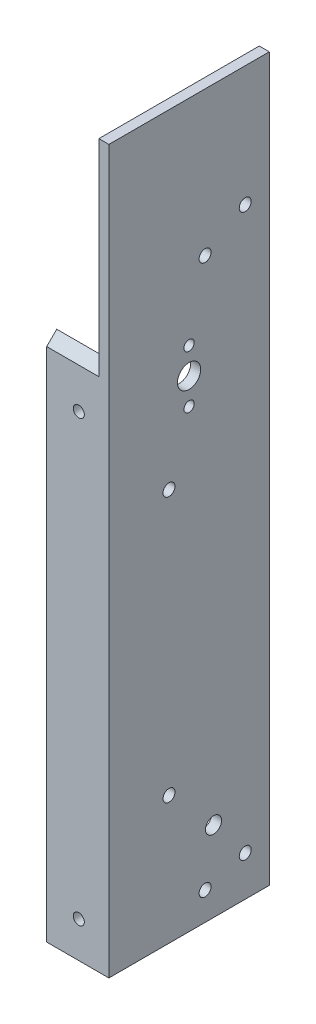
ISO-10303-21;
HEADER;
FILE_DESCRIPTION(('STEP AP214'),'2;1');
FILE_NAME('part.step','',(''),(''),'','','');
FILE_SCHEMA(('AUTOMOTIVE_DESIGN { 1 0 10303 214 1 1 1 1 }'));
ENDSEC;
DATA;
#1=APPLICATION_CONTEXT('core data for automotive mechanical design processes');
#2=APPLICATION_PROTOCOL_DEFINITION('international standard','automotive_design',2000,#1);
#3=PRODUCT_CONTEXT('',#1,'mechanical');
#4=PRODUCT('Part','Part','',(#3));
#5=PRODUCT_RELATED_PRODUCT_CATEGORY('part','',(#4));
#6=PRODUCT_DEFINITION_FORMATION('','',#4);
#7=PRODUCT_DEFINITION_CONTEXT('part definition',#1,'design');
#8=PRODUCT_DEFINITION('design','',#6,#7);
#9=PRODUCT_DEFINITION_SHAPE('','',#8);
#10=(LENGTH_UNIT() NAMED_UNIT(*) SI_UNIT(.MILLI.,.METRE.));
#11=(NAMED_UNIT(*) PLANE_ANGLE_UNIT() SI_UNIT($,.RADIAN.));
#12=(NAMED_UNIT(*) SI_UNIT($,.STERADIAN.) SOLID_ANGLE_UNIT());
#13=UNCERTAINTY_MEASURE_WITH_UNIT(LENGTH_MEASURE(1.E-05),#10,'distance_accuracy_value','');
#14=(GEOMETRIC_REPRESENTATION_CONTEXT(3) GLOBAL_UNCERTAINTY_ASSIGNED_CONTEXT((#13)) GLOBAL_UNIT_ASSIGNED_CONTEXT((#10,
#11,#12)) REPRESENTATION_CONTEXT('',''));
#15=CARTESIAN_POINT('',(0.,0.,0.));
#16=DIRECTION('',(0.,0.,1.));
#17=DIRECTION('',(1.,0.,0.));
#18=AXIS2_PLACEMENT_3D('',#15,#16,#17);
#19=CARTESIAN_POINT('',(0.,163.322,0.));
#20=DIRECTION('',(0.,-0.707106781186543,-0.707106781186552));
#21=DIRECTION('',(0.,0.707106781186552,-0.707106781186543));
#22=AXIS2_PLACEMENT_3D('',#19,#20,#21);
#23=PLANE('',#22);
#24=DIRECTION('',(0.,0.707106781186552,-0.707106781186543));
#25=VECTOR('',#24,1.);
#26=CARTESIAN_POINT('',(-3.175,163.322,0.));
#27=LINE('',#26,#25);
#28=CARTESIAN_POINT('',(-3.175,163.322,0.));
#29=VERTEX_POINT('',#28);
#30=CARTESIAN_POINT('',(-3.175,166.497,-3.175));
#31=VERTEX_POINT('',#30);
#32=EDGE_CURVE('E127',#29,#31,#27,.T.);
#33=ORIENTED_EDGE('',*,*,#32,.T.);
#34=DIRECTION('',(-1.,0.,0.));
#35=VECTOR('',#34,1.);
#36=CARTESIAN_POINT('',(-19.685,166.497,-3.17499999999999));
#37=LINE('',#36,#35);
#38=CARTESIAN_POINT('',(-19.685,166.497,-3.17499999999999));
#39=VERTEX_POINT('',#38);
#40=EDGE_CURVE('E196',#31,#39,#37,.T.);
#41=ORIENTED_EDGE('',*,*,#40,.T.);
#42=DIRECTION('',(0.,-0.707106781186552,0.707106781186543));
#43=VECTOR('',#42,1.);
#44=CARTESIAN_POINT('',(-19.685,163.322,0.));
#45=LINE('',#44,#43);
#46=CARTESIAN_POINT('',(-19.685,163.322,0.));
#47=VERTEX_POINT('',#46);
#48=EDGE_CURVE('E191',#39,#47,#45,.T.);
#49=ORIENTED_EDGE('',*,*,#48,.T.);
#50=DIRECTION('',(-1.,0.,0.));
#51=VECTOR('',#50,1.);
#52=CARTESIAN_POINT('',(0.,163.322,0.));
#53=LINE('',#52,#51);
#54=EDGE_CURVE('E194',#29,#47,#53,.T.);
#55=ORIENTED_EDGE('',*,*,#54,.F.);
#56=EDGE_LOOP('',(#33,#41,#49,#55));
#57=FACE_BOUND('',#56,.T.);
#58=ADVANCED_FACE('F46',(#57),#23,.F.);
#59=CARTESIAN_POINT('',(-19.685,203.2,0.));
#60=DIRECTION('',(-1.,0.,0.));
#61=DIRECTION('',(0.,0.,1.));
#62=AXIS2_PLACEMENT_3D('',#59,#60,#61);
#63=PLANE('',#62);
#64=ORIENTED_EDGE('',*,*,#48,.F.);
#65=DIRECTION('',(0.,-1.,0.));
#66=VECTOR('',#65,1.);
#67=CARTESIAN_POINT('',(-19.685,203.2,-3.17499999999999));
#68=LINE('',#67,#66);
#69=CARTESIAN_POINT('',(-19.685,0.,-3.17499999999999));
#70=VERTEX_POINT('',#69);
#71=EDGE_CURVE('E211',#39,#70,#68,.T.);
#72=ORIENTED_EDGE('',*,*,#71,.T.);
#73=DIRECTION('',(0.,0.,-1.));
#74=VECTOR('',#73,1.);
#75=CARTESIAN_POINT('',(-19.685,0.,0.));
#76=LINE('',#75,#74);
#77=CARTESIAN_POINT('',(-19.685,0.,0.));
#78=VERTEX_POINT('',#77);
#79=EDGE_CURVE('E198',#78,#70,#76,.T.);
#80=ORIENTED_EDGE('',*,*,#79,.F.);
#81=DIRECTION('',(0.,-1.,0.));
#82=VECTOR('',#81,1.);
#83=CARTESIAN_POINT('',(-19.685,203.2,0.));
#84=LINE('',#83,#82);
#85=EDGE_CURVE('E13',#47,#78,#84,.T.);
#86=ORIENTED_EDGE('',*,*,#85,.F.);
#87=EDGE_LOOP('',(#64,#72,#80,#86));
#88=FACE_BOUND('',#87,.T.);
#89=ADVANCED_FACE('F48',(#88),#63,.T.);
#90=CARTESIAN_POINT('',(0.,203.2,0.));
#91=DIRECTION('',(0.,0.,1.));
#92=DIRECTION('',(1.,0.,0.));
#93=AXIS2_PLACEMENT_3D('',#90,#91,#92);
#94=PLANE('',#93);
#95=CARTESIAN_POINT('',(-9.525,150.603948775786,0.));
#96=DIRECTION('',(0.,0.,-1.));
#97=DIRECTION('',(-1.,0.,0.));
#98=AXIS2_PLACEMENT_3D('',#95,#96,#97);
#99=CIRCLE('',#98,1.7526);
#100=CARTESIAN_POINT('',(-11.2776,150.603948775786,0.));
#101=VERTEX_POINT('',#100);
#102=EDGE_CURVE('E145',#101,#101,#99,.T.);
#103=ORIENTED_EDGE('',*,*,#102,.T.);
#104=EDGE_LOOP('',(#103));
#105=FACE_BOUND('',#104,.T.);
#106=CARTESIAN_POINT('',(-9.52500000000002,11.43,0.));
#107=DIRECTION('',(0.,0.,-1.));
#108=DIRECTION('',(-1.,0.,0.));
#109=AXIS2_PLACEMENT_3D('',#106,#107,#108);
#110=CIRCLE('',#109,1.7526);
#111=CARTESIAN_POINT('',(-11.2776,11.43,0.));
#112=VERTEX_POINT('',#111);
#113=EDGE_CURVE('E151',#112,#112,#110,.T.);
#114=ORIENTED_EDGE('',*,*,#113,.T.);
#115=EDGE_LOOP('',(#114));
#116=FACE_BOUND('',#115,.T.);
#117=DIRECTION('',(0.,-1.,0.));
#118=VECTOR('',#117,1.);
#119=CARTESIAN_POINT('',(0.,203.2,0.));
#120=LINE('',#119,#118);
#121=CARTESIAN_POINT('',(0.,228.6,0.));
#122=VERTEX_POINT('',#121);
#123=CARTESIAN_POINT('',(0.,0.,0.));
#124=VERTEX_POINT('',#123);
#125=EDGE_CURVE('E55',#122,#124,#120,.T.);
#126=ORIENTED_EDGE('',*,*,#125,.F.);
#127=DIRECTION('',(1.,0.,0.));
#128=VECTOR('',#127,1.);
#129=CARTESIAN_POINT('',(-3.175,228.6,0.));
#130=LINE('',#129,#128);
#131=CARTESIAN_POINT('',(-3.175,228.6,0.));
#132=VERTEX_POINT('',#131);
#133=EDGE_CURVE('E126',#132,#122,#130,.T.);
#134=ORIENTED_EDGE('',*,*,#133,.F.);
#135=DIRECTION('',(0.,-1.,0.));
#136=VECTOR('',#135,1.);
#137=CARTESIAN_POINT('',(-3.175,228.6,0.));
#138=LINE('',#137,#136);
#139=EDGE_CURVE('E133',#132,#29,#138,.T.);
#140=ORIENTED_EDGE('',*,*,#139,.T.);
#141=ORIENTED_EDGE('',*,*,#54,.T.);
#142=ORIENTED_EDGE('',*,*,#85,.T.);
#143=DIRECTION('',(-1.,0.,0.));
#144=VECTOR('',#143,1.);
#145=CARTESIAN_POINT('',(0.,0.,0.));
#146=LINE('',#145,#144);
#147=EDGE_CURVE('E209',#124,#78,#146,.T.);
#148=ORIENTED_EDGE('',*,*,#147,.F.);
#149=EDGE_LOOP('',(#126,#134,#140,#141,#142,#148));
#150=FACE_BOUND('',#149,.T.);
#151=ADVANCED_FACE('F240',(#105,#116,#150),#94,.T.);
#152=CARTESIAN_POINT('',(0.,203.2,-50.8));
#153=DIRECTION('',(1.,0.,0.));
#154=DIRECTION('',(0.,0.,-1.));
#155=AXIS2_PLACEMENT_3D('',#152,#153,#154);
#156=PLANE('',#155);
#157=CARTESIAN_POINT('',(0.,190.498941663727,-43.1799999999999));
#158=DIRECTION('',(-1.,0.,0.));
#159=DIRECTION('',(0.,0.,1.));
#160=AXIS2_PLACEMENT_3D('',#157,#158,#159);
#161=CIRCLE('',#160,1.89864999999999);
#162=CARTESIAN_POINT('',(0.,190.498941663727,-41.28135));
#163=VERTEX_POINT('',#162);
#164=EDGE_CURVE('E497',#163,#163,#161,.T.);
#165=ORIENTED_EDGE('',*,*,#164,.T.);
#166=EDGE_LOOP('',(#165));
#167=FACE_BOUND('',#166,.T.);
#168=CARTESIAN_POINT('',(0.,12.7,-43.1799999999999));
#169=DIRECTION('',(-1.,0.,0.));
#170=DIRECTION('',(0.,0.,1.));
#171=AXIS2_PLACEMENT_3D('',#168,#169,#170);
#172=CIRCLE('',#171,1.89865);
#173=CARTESIAN_POINT('',(0.,12.7,-41.2813499999999));
#174=VERTEX_POINT('',#173);
#175=EDGE_CURVE('E490',#174,#174,#172,.T.);
#176=ORIENTED_EDGE('',*,*,#175,.T.);
#177=EDGE_LOOP('',(#176));
#178=FACE_BOUND('',#177,.T.);
#179=CARTESIAN_POINT('',(0.,25.4,-33.1361964987955));
#180=DIRECTION('',(-1.,0.,0.));
#181=DIRECTION('',(0.,0.,1.));
#182=AXIS2_PLACEMENT_3D('',#179,#180,#181);
#183=CIRCLE('',#182,2.54000000000001);
#184=CARTESIAN_POINT('',(0.,25.4,-30.5961964987955));
#185=VERTEX_POINT('',#184);
#186=EDGE_CURVE('E136',#185,#185,#183,.T.);
#187=ORIENTED_EDGE('',*,*,#186,.T.);
#188=EDGE_LOOP('',(#187));
#189=FACE_BOUND('',#188,.T.);
#190=CARTESIAN_POINT('',(0.,124.397339992382,-19.05));
#191=DIRECTION('',(-1.,0.,0.));
#192=DIRECTION('',(0.,0.,1.));
#193=AXIS2_PLACEMENT_3D('',#190,#191,#192);
#194=CIRCLE('',#193,1.89865);
#195=CARTESIAN_POINT('',(0.,124.397339992382,-17.15135));
#196=VERTEX_POINT('',#195);
#197=EDGE_CURVE('E157',#196,#196,#194,.T.);
#198=ORIENTED_EDGE('',*,*,#197,.T.);
#199=EDGE_LOOP('',(#198));
#200=FACE_BOUND('',#199,.T.);
#201=CARTESIAN_POINT('',(0.,40.5773399923822,-19.05));
#202=DIRECTION('',(-1.,0.,0.));
#203=DIRECTION('',(0.,0.,1.));
#204=AXIS2_PLACEMENT_3D('',#201,#202,#203);
#205=CIRCLE('',#204,1.89865);
#206=CARTESIAN_POINT('',(0.,40.5773399923822,-17.15135));
#207=VERTEX_POINT('',#206);
#208=EDGE_CURVE('E163',#207,#207,#205,.T.);
#209=ORIENTED_EDGE('',*,*,#208,.T.);
#210=EDGE_LOOP('',(#209));
#211=FACE_BOUND('',#210,.T.);
#212=CARTESIAN_POINT('',(0.,8.89000000000001,-30.48));
#213=DIRECTION('',(-1.,0.,0.));
#214=DIRECTION('',(0.,0.,1.));
#215=AXIS2_PLACEMENT_3D('',#212,#213,#214);
#216=CIRCLE('',#215,1.89865);
#217=CARTESIAN_POINT('',(0.,8.89000000000001,-28.58135));
#218=VERTEX_POINT('',#217);
#219=EDGE_CURVE('E169',#218,#218,#216,.T.);
#220=ORIENTED_EDGE('',*,*,#219,.T.);
#221=EDGE_LOOP('',(#220));
#222=FACE_BOUND('',#221,.T.);
#223=CARTESIAN_POINT('',(0.,182.88,-30.4799999999998));
#224=DIRECTION('',(-1.,0.,0.));
#225=DIRECTION('',(0.,0.,1.));
#226=AXIS2_PLACEMENT_3D('',#223,#224,#225);
#227=CIRCLE('',#226,1.89865);
#228=CARTESIAN_POINT('',(0.,182.88,-28.5813499999998));
#229=VERTEX_POINT('',#228);
#230=EDGE_CURVE('E175',#229,#229,#227,.T.);
#231=ORIENTED_EDGE('',*,*,#230,.T.);
#232=EDGE_LOOP('',(#231));
#233=FACE_BOUND('',#232,.T.);
#234=CARTESIAN_POINT('',(0.,144.018,-25.4));
#235=DIRECTION('',(1.,0.,0.));
#236=DIRECTION('',(0.,0.,-1.));
#237=AXIS2_PLACEMENT_3D('',#234,#235,#236);
#238=CIRCLE('',#237,1.63195000000001);
#239=CARTESIAN_POINT('',(0.,144.018,-27.03195));
#240=VERTEX_POINT('',#239);
#241=EDGE_CURVE('E178',#240,#240,#238,.T.);
#242=ORIENTED_EDGE('',*,*,#241,.F.);
#243=EDGE_LOOP('',(#242));
#244=FACE_BOUND('',#243,.T.);
#245=CARTESIAN_POINT('',(0.,160.782,-25.4));
#246=DIRECTION('',(1.,0.,0.));
#247=DIRECTION('',(0.,0.,-1.));
#248=AXIS2_PLACEMENT_3D('',#245,#246,#247);
#249=CIRCLE('',#248,1.63195000000002);
#250=CARTESIAN_POINT('',(0.,160.782,-27.03195));
#251=VERTEX_POINT('',#250);
#252=EDGE_CURVE('E183',#251,#251,#249,.T.);
#253=ORIENTED_EDGE('',*,*,#252,.F.);
#254=EDGE_LOOP('',(#253));
#255=FACE_BOUND('',#254,.T.);
#256=CARTESIAN_POINT('',(0.,152.4,-25.4));
#257=DIRECTION('',(1.,0.,0.));
#258=DIRECTION('',(0.,0.,-1.));
#259=AXIS2_PLACEMENT_3D('',#256,#257,#258);
#260=CIRCLE('',#259,3.68299999999999);
#261=CARTESIAN_POINT('',(0.,152.4,-29.083));
#262=VERTEX_POINT('',#261);
#263=EDGE_CURVE('E187',#262,#262,#260,.T.);
#264=ORIENTED_EDGE('',*,*,#263,.F.);
#265=EDGE_LOOP('',(#264));
#266=FACE_BOUND('',#265,.T.);
#267=DIRECTION('',(0.,-1.,0.));
#268=VECTOR('',#267,1.);
#269=CARTESIAN_POINT('',(0.,203.2,-50.8));
#270=LINE('',#269,#268);
#271=CARTESIAN_POINT('',(0.,228.6,-50.8));
#272=VERTEX_POINT('',#271);
#273=CARTESIAN_POINT('',(0.,0.,-50.8));
#274=VERTEX_POINT('',#273);
#275=EDGE_CURVE('E117',#272,#274,#270,.T.);
#276=ORIENTED_EDGE('',*,*,#275,.F.);
#277=DIRECTION('',(0.,0.,1.));
#278=VECTOR('',#277,1.);
#279=CARTESIAN_POINT('',(0.,228.6,-50.8));
#280=LINE('',#279,#278);
#281=EDGE_CURVE('E125',#272,#122,#280,.T.);
#282=ORIENTED_EDGE('',*,*,#281,.T.);
#283=ORIENTED_EDGE('',*,*,#125,.T.);
#284=DIRECTION('',(0.,0.,1.));
#285=VECTOR('',#284,1.);
#286=CARTESIAN_POINT('',(0.,0.,-50.8));
#287=LINE('',#286,#285);
#288=EDGE_CURVE('E207',#274,#124,#287,.T.);
#289=ORIENTED_EDGE('',*,*,#288,.F.);
#290=EDGE_LOOP('',(#276,#282,#283,#289));
#291=FACE_BOUND('',#290,.T.);
#292=ADVANCED_FACE('F238',(#167,#178,#189,#200,#211,#222,#233,#244,#255,#266,#291),#156,.T.);
#293=CARTESIAN_POINT('',(-3.17500000000002,203.2,-50.8));
#294=DIRECTION('',(0.,0.,-1.));
#295=DIRECTION('',(-1.,0.,0.));
#296=AXIS2_PLACEMENT_3D('',#293,#294,#295);
#297=PLANE('',#296);
#298=DIRECTION('',(1.,0.,0.));
#299=VECTOR('',#298,1.);
#300=CARTESIAN_POINT('',(-3.17500000000002,0.,-50.8));
#301=LINE('',#300,#299);
#302=CARTESIAN_POINT('',(-3.17500000000002,0.,-50.8));
#303=VERTEX_POINT('',#302);
#304=EDGE_CURVE('E112',#303,#274,#301,.T.);
#305=ORIENTED_EDGE('',*,*,#304,.F.);
#306=DIRECTION('',(0.,-1.,0.));
#307=VECTOR('',#306,1.);
#308=CARTESIAN_POINT('',(-3.17500000000002,203.2,-50.8));
#309=LINE('',#308,#307);
#310=CARTESIAN_POINT('',(-3.175,228.6,-50.8));
#311=VERTEX_POINT('',#310);
#312=EDGE_CURVE('E106',#311,#303,#309,.T.);
#313=ORIENTED_EDGE('',*,*,#312,.F.);
#314=DIRECTION('',(1.,0.,0.));
#315=VECTOR('',#314,1.);
#316=CARTESIAN_POINT('',(-3.175,228.6,-50.8));
#317=LINE('',#316,#315);
#318=EDGE_CURVE('E109',#311,#272,#317,.T.);
#319=ORIENTED_EDGE('',*,*,#318,.T.);
#320=ORIENTED_EDGE('',*,*,#275,.T.);
#321=EDGE_LOOP('',(#305,#313,#319,#320));
#322=FACE_BOUND('',#321,.T.);
#323=ADVANCED_FACE('F108',(#322),#297,.T.);
#324=CARTESIAN_POINT('',(-3.17500000000002,203.2,-3.175));
#325=DIRECTION('',(-1.,0.,0.));
#326=DIRECTION('',(0.,0.,1.));
#327=AXIS2_PLACEMENT_3D('',#324,#325,#326);
#328=PLANE('',#327);
#329=CARTESIAN_POINT('',(-3.17500000000002,190.498941663727,-43.1799999999999));
#330=DIRECTION('',(-1.,0.,0.));
#331=DIRECTION('',(0.,0.,1.));
#332=AXIS2_PLACEMENT_3D('',#329,#330,#331);
#333=CIRCLE('',#332,1.89864999999999);
#334=CARTESIAN_POINT('',(-3.17500000000002,190.498941663727,-41.28135));
#335=VERTEX_POINT('',#334);
#336=EDGE_CURVE('E500',#335,#335,#333,.T.);
#337=ORIENTED_EDGE('',*,*,#336,.F.);
#338=EDGE_LOOP('',(#337));
#339=FACE_BOUND('',#338,.T.);
#340=CARTESIAN_POINT('',(-3.17500000000002,12.7,-43.1799999999999));
#341=DIRECTION('',(-1.,0.,0.));
#342=DIRECTION('',(0.,0.,1.));
#343=AXIS2_PLACEMENT_3D('',#340,#341,#342);
#344=CIRCLE('',#343,1.89865);
#345=CARTESIAN_POINT('',(-3.17500000000002,12.7,-41.2813499999999));
#346=VERTEX_POINT('',#345);
#347=EDGE_CURVE('E492',#346,#346,#344,.T.);
#348=ORIENTED_EDGE('',*,*,#347,.F.);
#349=EDGE_LOOP('',(#348));
#350=FACE_BOUND('',#349,.T.);
#351=CARTESIAN_POINT('',(-3.17500000000002,25.4,-33.1361964987955));
#352=DIRECTION('',(-1.,0.,0.));
#353=DIRECTION('',(0.,0.,1.));
#354=AXIS2_PLACEMENT_3D('',#351,#352,#353);
#355=CIRCLE('',#354,2.54000000000001);
#356=CARTESIAN_POINT('',(-3.17500000000002,25.4,-30.5961964987955));
#357=VERTEX_POINT('',#356);
#358=EDGE_CURVE('E139',#357,#357,#355,.T.);
#359=ORIENTED_EDGE('',*,*,#358,.F.);
#360=EDGE_LOOP('',(#359));
#361=FACE_BOUND('',#360,.T.);
#362=DIRECTION('',(0.,0.,1.));
#363=VECTOR('',#362,1.);
#364=CARTESIAN_POINT('',(-3.175,228.6,-50.8));
#365=LINE('',#364,#363);
#366=EDGE_CURVE('E124',#311,#132,#365,.T.);
#367=ORIENTED_EDGE('',*,*,#366,.F.);
#368=ORIENTED_EDGE('',*,*,#312,.T.);
#369=DIRECTION('',(0.,0.,-1.));
#370=VECTOR('',#369,1.);
#371=CARTESIAN_POINT('',(-3.17500000000002,0.,-3.175));
#372=LINE('',#371,#370);
#373=CARTESIAN_POINT('',(-3.17500000000002,0.,-3.175));
#374=VERTEX_POINT('',#373);
#375=EDGE_CURVE('E204',#374,#303,#372,.T.);
#376=ORIENTED_EDGE('',*,*,#375,.F.);
#377=DIRECTION('',(0.,-1.,0.));
#378=VECTOR('',#377,1.);
#379=CARTESIAN_POINT('',(-3.17500000000002,203.2,-3.175));
#380=LINE('',#379,#378);
#381=EDGE_CURVE('E118',#31,#374,#380,.T.);
#382=ORIENTED_EDGE('',*,*,#381,.F.);
#383=ORIENTED_EDGE('',*,*,#32,.F.);
#384=ORIENTED_EDGE('',*,*,#139,.F.);
#385=EDGE_LOOP('',(#367,#368,#376,#382,#383,#384));
#386=FACE_BOUND('',#385,.T.);
#387=CARTESIAN_POINT('',(-3.17500000000002,124.397339992382,-19.05));
#388=DIRECTION('',(-1.,0.,0.));
#389=DIRECTION('',(0.,0.,1.));
#390=AXIS2_PLACEMENT_3D('',#387,#388,#389);
#391=CIRCLE('',#390,1.89865);
#392=CARTESIAN_POINT('',(-3.17500000000002,124.397339992382,-17.15135));
#393=VERTEX_POINT('',#392);
#394=EDGE_CURVE('E154',#393,#393,#391,.T.);
#395=ORIENTED_EDGE('',*,*,#394,.F.);
#396=EDGE_LOOP('',(#395));
#397=FACE_BOUND('',#396,.T.);
#398=CARTESIAN_POINT('',(-3.17500000000002,40.5773399923822,-19.05));
#399=DIRECTION('',(-1.,0.,0.));
#400=DIRECTION('',(0.,0.,1.));
#401=AXIS2_PLACEMENT_3D('',#398,#399,#400);
#402=CIRCLE('',#401,1.89865);
#403=CARTESIAN_POINT('',(-3.17500000000002,40.5773399923822,-17.15135));
#404=VERTEX_POINT('',#403);
#405=EDGE_CURVE('E160',#404,#404,#402,.T.);
#406=ORIENTED_EDGE('',*,*,#405,.F.);
#407=EDGE_LOOP('',(#406));
#408=FACE_BOUND('',#407,.T.);
#409=CARTESIAN_POINT('',(-3.17500000000002,8.89000000000001,-30.48));
#410=DIRECTION('',(-1.,0.,0.));
#411=DIRECTION('',(0.,0.,1.));
#412=AXIS2_PLACEMENT_3D('',#409,#410,#411);
#413=CIRCLE('',#412,1.89865);
#414=CARTESIAN_POINT('',(-3.17500000000002,8.89000000000001,-28.58135));
#415=VERTEX_POINT('',#414);
#416=EDGE_CURVE('E166',#415,#415,#413,.T.);
#417=ORIENTED_EDGE('',*,*,#416,.F.);
#418=EDGE_LOOP('',(#417));
#419=FACE_BOUND('',#418,.T.);
#420=CARTESIAN_POINT('',(-3.17500000000002,182.88,-30.4799999999998));
#421=DIRECTION('',(-1.,0.,0.));
#422=DIRECTION('',(0.,0.,1.));
#423=AXIS2_PLACEMENT_3D('',#420,#421,#422);
#424=CIRCLE('',#423,1.89865);
#425=CARTESIAN_POINT('',(-3.17500000000002,182.88,-28.5813499999998));
#426=VERTEX_POINT('',#425);
#427=EDGE_CURVE('E172',#426,#426,#424,.T.);
#428=ORIENTED_EDGE('',*,*,#427,.F.);
#429=EDGE_LOOP('',(#428));
#430=FACE_BOUND('',#429,.T.);
#431=CARTESIAN_POINT('',(-3.17500000000001,144.018,-25.4));
#432=DIRECTION('',(-1.,0.,0.));
#433=DIRECTION('',(0.,0.,1.));
#434=AXIS2_PLACEMENT_3D('',#431,#432,#433);
#435=CIRCLE('',#434,1.63195000000001);
#436=CARTESIAN_POINT('',(-3.17500000000001,144.018,-23.76805));
#437=VERTEX_POINT('',#436);
#438=EDGE_CURVE('E50',#437,#437,#435,.T.);
#439=ORIENTED_EDGE('',*,*,#438,.F.);
#440=EDGE_LOOP('',(#439));
#441=FACE_BOUND('',#440,.T.);
#442=CARTESIAN_POINT('',(-3.17500000000001,160.782,-25.4));
#443=DIRECTION('',(-1.,0.,0.));
#444=DIRECTION('',(0.,0.,1.));
#445=AXIS2_PLACEMENT_3D('',#442,#443,#444);
#446=CIRCLE('',#445,1.63195000000002);
#447=CARTESIAN_POINT('',(-3.17500000000001,160.782,-23.76805));
#448=VERTEX_POINT('',#447);
#449=EDGE_CURVE('E186',#448,#448,#446,.T.);
#450=ORIENTED_EDGE('',*,*,#449,.F.);
#451=EDGE_LOOP('',(#450));
#452=FACE_BOUND('',#451,.T.);
#453=CARTESIAN_POINT('',(-3.17500000000001,152.4,-25.4));
#454=DIRECTION('',(-1.,0.,0.));
#455=DIRECTION('',(0.,0.,1.));
#456=AXIS2_PLACEMENT_3D('',#453,#454,#455);
#457=CIRCLE('',#456,3.68299999999999);
#458=CARTESIAN_POINT('',(-3.17500000000001,152.4,-21.717));
#459=VERTEX_POINT('',#458);
#460=EDGE_CURVE('E190',#459,#459,#457,.T.);
#461=ORIENTED_EDGE('',*,*,#460,.F.);
#462=EDGE_LOOP('',(#461));
#463=FACE_BOUND('',#462,.T.);
#464=ADVANCED_FACE('F130',(#339,#350,#361,#386,#397,#408,#419,#430,#441,#452,#463),#328,.T.);
#465=CARTESIAN_POINT('',(-19.685,203.2,-3.17499999999999));
#466=DIRECTION('',(0.,0.,-1.));
#467=DIRECTION('',(-1.,0.,0.));
#468=AXIS2_PLACEMENT_3D('',#465,#466,#467);
#469=PLANE('',#468);
#470=CARTESIAN_POINT('',(-9.52500000000001,150.603948775786,-3.175));
#471=DIRECTION('',(0.,0.,-1.));
#472=DIRECTION('',(-1.,0.,0.));
#473=AXIS2_PLACEMENT_3D('',#470,#471,#472);
#474=CIRCLE('',#473,1.7526);
#475=CARTESIAN_POINT('',(-11.2776,150.603948775786,-3.175));
#476=VERTEX_POINT('',#475);
#477=EDGE_CURVE('E143',#476,#476,#474,.T.);
#478=ORIENTED_EDGE('',*,*,#477,.F.);
#479=EDGE_LOOP('',(#478));
#480=FACE_BOUND('',#479,.T.);
#481=CARTESIAN_POINT('',(-9.52500000000002,11.43,-3.175));
#482=DIRECTION('',(0.,0.,-1.));
#483=DIRECTION('',(-1.,0.,0.));
#484=AXIS2_PLACEMENT_3D('',#481,#482,#483);
#485=CIRCLE('',#484,1.7526);
#486=CARTESIAN_POINT('',(-11.2776,11.43,-3.175));
#487=VERTEX_POINT('',#486);
#488=EDGE_CURVE('E148',#487,#487,#485,.T.);
#489=ORIENTED_EDGE('',*,*,#488,.F.);
#490=EDGE_LOOP('',(#489));
#491=FACE_BOUND('',#490,.T.);
#492=ORIENTED_EDGE('',*,*,#40,.F.);
#493=ORIENTED_EDGE('',*,*,#381,.T.);
#494=DIRECTION('',(1.,0.,0.));
#495=VECTOR('',#494,1.);
#496=CARTESIAN_POINT('',(-19.685,0.,-3.17499999999999));
#497=LINE('',#496,#495);
#498=EDGE_CURVE('E201',#70,#374,#497,.T.);
#499=ORIENTED_EDGE('',*,*,#498,.F.);
#500=ORIENTED_EDGE('',*,*,#71,.F.);
#501=EDGE_LOOP('',(#492,#493,#499,#500));
#502=FACE_BOUND('',#501,.T.);
#503=ADVANCED_FACE('F226',(#480,#491,#502),#469,.T.);
#504=CARTESIAN_POINT('',(0.,0.,0.));
#505=DIRECTION('',(0.,-1.,0.));
#506=DIRECTION('',(0.,0.,-1.));
#507=AXIS2_PLACEMENT_3D('',#504,#505,#506);
#508=PLANE('',#507);
#509=ORIENTED_EDGE('',*,*,#79,.T.);
#510=ORIENTED_EDGE('',*,*,#498,.T.);
#511=ORIENTED_EDGE('',*,*,#375,.T.);
#512=ORIENTED_EDGE('',*,*,#304,.T.);
#513=ORIENTED_EDGE('',*,*,#288,.T.);
#514=ORIENTED_EDGE('',*,*,#147,.T.);
#515=EDGE_LOOP('',(#509,#510,#511,#512,#513,#514));
#516=FACE_BOUND('',#515,.T.);
#517=ADVANCED_FACE('F234',(#516),#508,.T.);
#518=CARTESIAN_POINT('',(-19.685,152.4,-25.4));
#519=DIRECTION('',(1.,0.,0.));
#520=DIRECTION('',(0.,0.,-1.));
#521=AXIS2_PLACEMENT_3D('',#518,#519,#520);
#522=CYLINDRICAL_SURFACE('',#521,3.68299999999999);
#523=ORIENTED_EDGE('',*,*,#460,.T.);
#524=EDGE_LOOP('',(#523));
#525=FACE_BOUND('',#524,.T.);
#526=ORIENTED_EDGE('',*,*,#263,.T.);
#527=EDGE_LOOP('',(#526));
#528=FACE_BOUND('',#527,.T.);
#529=ADVANCED_FACE('F231',(#525,#528),#522,.F.);
#530=CARTESIAN_POINT('',(-19.685,160.782,-25.4));
#531=DIRECTION('',(1.,0.,0.));
#532=DIRECTION('',(0.,0.,-1.));
#533=AXIS2_PLACEMENT_3D('',#530,#531,#532);
#534=CYLINDRICAL_SURFACE('',#533,1.63195000000002);
#535=ORIENTED_EDGE('',*,*,#449,.T.);
#536=EDGE_LOOP('',(#535));
#537=FACE_BOUND('',#536,.T.);
#538=ORIENTED_EDGE('',*,*,#252,.T.);
#539=EDGE_LOOP('',(#538));
#540=FACE_BOUND('',#539,.T.);
#541=ADVANCED_FACE('F221',(#537,#540),#534,.F.);
#542=CARTESIAN_POINT('',(-19.685,144.018,-25.4));
#543=DIRECTION('',(1.,0.,0.));
#544=DIRECTION('',(0.,0.,-1.));
#545=AXIS2_PLACEMENT_3D('',#542,#543,#544);
#546=CYLINDRICAL_SURFACE('',#545,1.63195000000001);
#547=ORIENTED_EDGE('',*,*,#438,.T.);
#548=EDGE_LOOP('',(#547));
#549=FACE_BOUND('',#548,.T.);
#550=ORIENTED_EDGE('',*,*,#241,.T.);
#551=EDGE_LOOP('',(#550));
#552=FACE_BOUND('',#551,.T.);
#553=ADVANCED_FACE('F347',(#549,#552),#546,.F.);
#554=CARTESIAN_POINT('',(0.,182.88,-30.4799999999998));
#555=DIRECTION('',(-1.,0.,0.));
#556=DIRECTION('',(0.,0.,1.));
#557=AXIS2_PLACEMENT_3D('',#554,#555,#556);
#558=CYLINDRICAL_SURFACE('',#557,1.89865);
#559=ORIENTED_EDGE('',*,*,#230,.F.);
#560=EDGE_LOOP('',(#559));
#561=FACE_BOUND('',#560,.T.);
#562=ORIENTED_EDGE('',*,*,#427,.T.);
#563=EDGE_LOOP('',(#562));
#564=FACE_BOUND('',#563,.T.);
#565=ADVANCED_FACE('F343',(#561,#564),#558,.F.);
#566=CARTESIAN_POINT('',(0.,8.89000000000001,-30.48));
#567=DIRECTION('',(-1.,0.,0.));
#568=DIRECTION('',(0.,0.,1.));
#569=AXIS2_PLACEMENT_3D('',#566,#567,#568);
#570=CYLINDRICAL_SURFACE('',#569,1.89865);
#571=ORIENTED_EDGE('',*,*,#219,.F.);
#572=EDGE_LOOP('',(#571));
#573=FACE_BOUND('',#572,.T.);
#574=ORIENTED_EDGE('',*,*,#416,.T.);
#575=EDGE_LOOP('',(#574));
#576=FACE_BOUND('',#575,.T.);
#577=ADVANCED_FACE('F339',(#573,#576),#570,.F.);
#578=CARTESIAN_POINT('',(0.,40.5773399923822,-19.05));
#579=DIRECTION('',(-1.,0.,0.));
#580=DIRECTION('',(0.,0.,1.));
#581=AXIS2_PLACEMENT_3D('',#578,#579,#580);
#582=CYLINDRICAL_SURFACE('',#581,1.89865);
#583=ORIENTED_EDGE('',*,*,#208,.F.);
#584=EDGE_LOOP('',(#583));
#585=FACE_BOUND('',#584,.T.);
#586=ORIENTED_EDGE('',*,*,#405,.T.);
#587=EDGE_LOOP('',(#586));
#588=FACE_BOUND('',#587,.T.);
#589=ADVANCED_FACE('F335',(#585,#588),#582,.F.);
#590=CARTESIAN_POINT('',(0.,124.397339992382,-19.05));
#591=DIRECTION('',(-1.,0.,0.));
#592=DIRECTION('',(0.,0.,1.));
#593=AXIS2_PLACEMENT_3D('',#590,#591,#592);
#594=CYLINDRICAL_SURFACE('',#593,1.89865);
#595=ORIENTED_EDGE('',*,*,#197,.F.);
#596=EDGE_LOOP('',(#595));
#597=FACE_BOUND('',#596,.T.);
#598=ORIENTED_EDGE('',*,*,#394,.T.);
#599=EDGE_LOOP('',(#598));
#600=FACE_BOUND('',#599,.T.);
#601=ADVANCED_FACE('F331',(#597,#600),#594,.F.);
#602=CARTESIAN_POINT('',(-9.52500000000002,11.43,0.));
#603=DIRECTION('',(0.,0.,-1.));
#604=DIRECTION('',(-1.,0.,0.));
#605=AXIS2_PLACEMENT_3D('',#602,#603,#604);
#606=CYLINDRICAL_SURFACE('',#605,1.7526);
#607=ORIENTED_EDGE('',*,*,#113,.F.);
#608=EDGE_LOOP('',(#607));
#609=FACE_BOUND('',#608,.T.);
#610=ORIENTED_EDGE('',*,*,#488,.T.);
#611=EDGE_LOOP('',(#610));
#612=FACE_BOUND('',#611,.T.);
#613=ADVANCED_FACE('F327',(#609,#612),#606,.F.);
#614=CARTESIAN_POINT('',(-9.525,150.603948775786,0.));
#615=DIRECTION('',(0.,0.,-1.));
#616=DIRECTION('',(-1.,0.,0.));
#617=AXIS2_PLACEMENT_3D('',#614,#615,#616);
#618=CYLINDRICAL_SURFACE('',#617,1.7526);
#619=ORIENTED_EDGE('',*,*,#102,.F.);
#620=EDGE_LOOP('',(#619));
#621=FACE_BOUND('',#620,.T.);
#622=ORIENTED_EDGE('',*,*,#477,.T.);
#623=EDGE_LOOP('',(#622));
#624=FACE_BOUND('',#623,.T.);
#625=ADVANCED_FACE('F324',(#621,#624),#618,.F.);
#626=CARTESIAN_POINT('',(-3.175,228.6,-50.8));
#627=DIRECTION('',(0.,1.,0.));
#628=DIRECTION('',(0.,0.,1.));
#629=AXIS2_PLACEMENT_3D('',#626,#627,#628);
#630=PLANE('',#629);
#631=ORIENTED_EDGE('',*,*,#281,.F.);
#632=ORIENTED_EDGE('',*,*,#318,.F.);
#633=ORIENTED_EDGE('',*,*,#366,.T.);
#634=ORIENTED_EDGE('',*,*,#133,.T.);
#635=EDGE_LOOP('',(#631,#632,#633,#634));
#636=FACE_BOUND('',#635,.T.);
#637=ADVANCED_FACE('F122',(#636),#630,.T.);
#638=CARTESIAN_POINT('',(0.,25.4,-33.1361964987955));
#639=DIRECTION('',(-1.,0.,0.));
#640=DIRECTION('',(0.,0.,1.));
#641=AXIS2_PLACEMENT_3D('',#638,#639,#640);
#642=CYLINDRICAL_SURFACE('',#641,2.54000000000001);
#643=ORIENTED_EDGE('',*,*,#186,.F.);
#644=EDGE_LOOP('',(#643));
#645=FACE_BOUND('',#644,.T.);
#646=ORIENTED_EDGE('',*,*,#358,.T.);
#647=EDGE_LOOP('',(#646));
#648=FACE_BOUND('',#647,.T.);
#649=ADVANCED_FACE('F301',(#645,#648),#642,.F.);
#650=CARTESIAN_POINT('',(0.,12.7,-43.1799999999999));
#651=DIRECTION('',(-1.,0.,0.));
#652=DIRECTION('',(0.,0.,1.));
#653=AXIS2_PLACEMENT_3D('',#650,#651,#652);
#654=CYLINDRICAL_SURFACE('',#653,1.89865);
#655=ORIENTED_EDGE('',*,*,#175,.F.);
#656=EDGE_LOOP('',(#655));
#657=FACE_BOUND('',#656,.T.);
#658=ORIENTED_EDGE('',*,*,#347,.T.);
#659=EDGE_LOOP('',(#658));
#660=FACE_BOUND('',#659,.T.);
#661=ADVANCED_FACE('F295',(#657,#660),#654,.F.);
#662=CARTESIAN_POINT('',(0.,190.498941663727,-43.1799999999999));
#663=DIRECTION('',(-1.,0.,0.));
#664=DIRECTION('',(0.,0.,1.));
#665=AXIS2_PLACEMENT_3D('',#662,#663,#664);
#666=CYLINDRICAL_SURFACE('',#665,1.89864999999999);
#667=ORIENTED_EDGE('',*,*,#164,.F.);
#668=EDGE_LOOP('',(#667));
#669=FACE_BOUND('',#668,.T.);
#670=ORIENTED_EDGE('',*,*,#336,.T.);
#671=EDGE_LOOP('',(#670));
#672=FACE_BOUND('',#671,.T.);
#673=ADVANCED_FACE('F300',(#669,#672),#666,.F.);
#674=CLOSED_SHELL('',(#58,#89,#151,#292,#323,#464,#503,#517,#529,#541,#553,#565,#577,#589,#601,
#613,#625,#637,#649,#661,#673));
#675=MANIFOLD_SOLID_BREP('B2',#674);
#676=ADVANCED_BREP_SHAPE_REPRESENTATION('',(#18,#675),#14);
#677=SHAPE_DEFINITION_REPRESENTATION(#9,#676);
ENDSEC;
END-ISO-10303-21;
